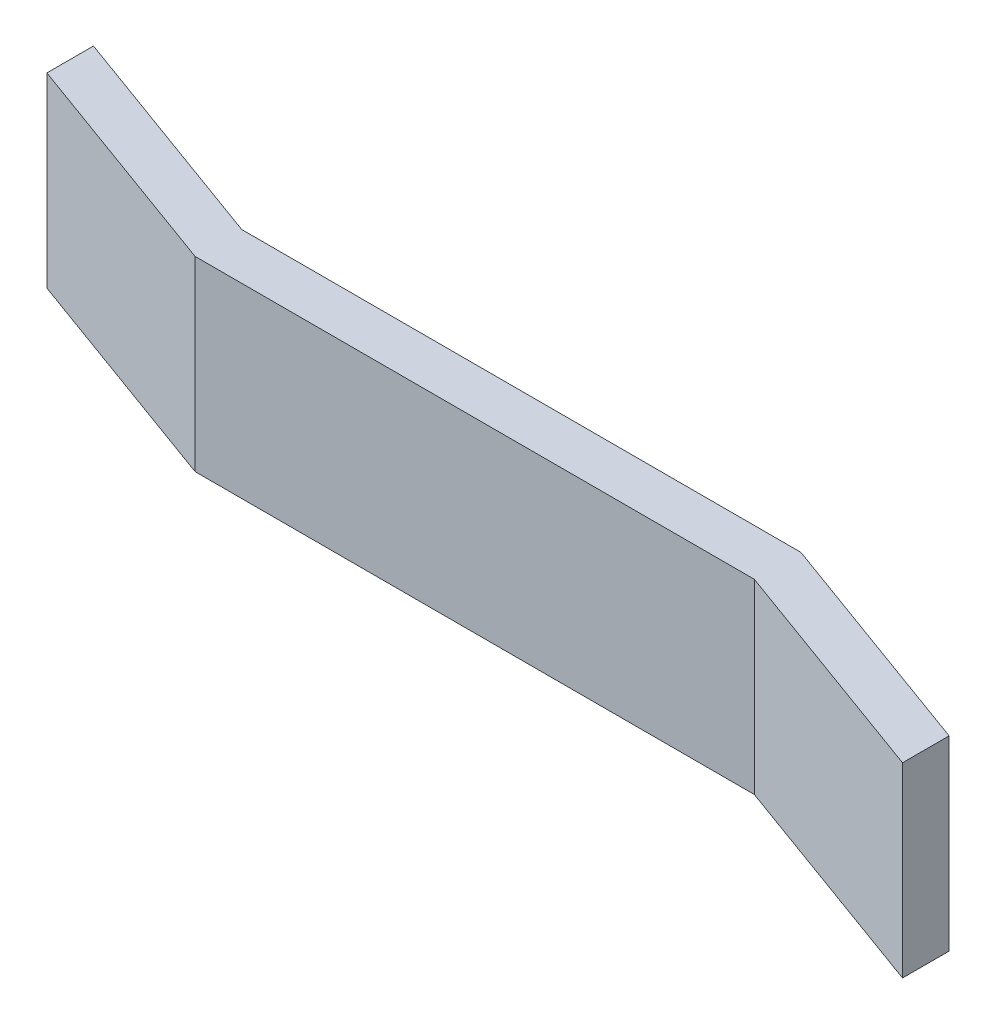
ISO-10303-21;
HEADER;
FILE_DESCRIPTION(('STEP AP214'),'2;1');
FILE_NAME('part.step','',(''),(''),'','','');
FILE_SCHEMA(('AUTOMOTIVE_DESIGN { 1 0 10303 214 1 1 1 1 }'));
ENDSEC;
DATA;
#1=APPLICATION_CONTEXT('core data for automotive mechanical design processes');
#2=APPLICATION_PROTOCOL_DEFINITION('international standard','automotive_design',2000,#1);
#3=PRODUCT_CONTEXT('',#1,'mechanical');
#4=PRODUCT('Part','Part','',(#3));
#5=PRODUCT_RELATED_PRODUCT_CATEGORY('part','',(#4));
#6=PRODUCT_DEFINITION_FORMATION('','',#4);
#7=PRODUCT_DEFINITION_CONTEXT('part definition',#1,'design');
#8=PRODUCT_DEFINITION('design','',#6,#7);
#9=PRODUCT_DEFINITION_SHAPE('','',#8);
#10=(LENGTH_UNIT() NAMED_UNIT(*) SI_UNIT(.MILLI.,.METRE.));
#11=(NAMED_UNIT(*) PLANE_ANGLE_UNIT() SI_UNIT($,.RADIAN.));
#12=(NAMED_UNIT(*) SI_UNIT($,.STERADIAN.) SOLID_ANGLE_UNIT());
#13=UNCERTAINTY_MEASURE_WITH_UNIT(LENGTH_MEASURE(1.E-05),#10,'distance_accuracy_value','');
#14=(GEOMETRIC_REPRESENTATION_CONTEXT(3) GLOBAL_UNCERTAINTY_ASSIGNED_CONTEXT((#13)) GLOBAL_UNIT_ASSIGNED_CONTEXT((#10,
#11,#12)) REPRESENTATION_CONTEXT('',''));
#15=CARTESIAN_POINT('',(0.,0.,0.));
#16=DIRECTION('',(0.,0.,1.));
#17=DIRECTION('',(1.,0.,0.));
#18=AXIS2_PLACEMENT_3D('',#15,#16,#17);
#19=CARTESIAN_POINT('',(-25.,20.,0.));
#20=DIRECTION('',(-1.,0.,0.));
#21=DIRECTION('',(0.,0.,1.));
#22=AXIS2_PLACEMENT_3D('',#19,#20,#21);
#23=PLANE('',#22);
#24=DIRECTION('',(0.,0.,-1.));
#25=VECTOR('',#24,1.);
#26=CARTESIAN_POINT('',(-25.,0.,0.));
#27=LINE('',#26,#25);
#28=CARTESIAN_POINT('',(-25.,0.,-9.09925585665488));
#29=VERTEX_POINT('',#28);
#30=CARTESIAN_POINT('',(-25.,0.,-14.0992558566549));
#31=VERTEX_POINT('',#30);
#32=EDGE_CURVE('E131',#29,#31,#27,.T.);
#33=ORIENTED_EDGE('',*,*,#32,.F.);
#34=DIRECTION('',(0.,-1.,0.));
#35=VECTOR('',#34,1.);
#36=CARTESIAN_POINT('',(-25.,20.,-9.09925585665488));
#37=LINE('',#36,#35);
#38=CARTESIAN_POINT('',(-25.,20.,-9.09925585665488));
#39=VERTEX_POINT('',#38);
#40=EDGE_CURVE('E11',#39,#29,#37,.T.);
#41=ORIENTED_EDGE('',*,*,#40,.F.);
#42=DIRECTION('',(0.,0.,-1.));
#43=VECTOR('',#42,1.);
#44=CARTESIAN_POINT('',(-25.,20.,0.));
#45=LINE('',#44,#43);
#46=CARTESIAN_POINT('',(-25.,20.,-14.0992558566549));
#47=VERTEX_POINT('',#46);
#48=EDGE_CURVE('E149',#39,#47,#45,.T.);
#49=ORIENTED_EDGE('',*,*,#48,.T.);
#50=DIRECTION('',(0.,-1.,0.));
#51=VECTOR('',#50,1.);
#52=CARTESIAN_POINT('',(-25.,20.,-14.0992558566549));
#53=LINE('',#52,#51);
#54=EDGE_CURVE('E89',#47,#31,#53,.T.);
#55=ORIENTED_EDGE('',*,*,#54,.T.);
#56=EDGE_LOOP('',(#33,#41,#49,#55));
#57=FACE_BOUND('',#56,.T.);
#58=ADVANCED_FACE('F39',(#57),#23,.T.);
#59=CARTESIAN_POINT('',(0.,20.,0.));
#60=DIRECTION('',(-0.342020143325663,0.,0.939692620785911));
#61=DIRECTION('',(0.939692620785911,0.,0.342020143325663));
#62=AXIS2_PLACEMENT_3D('',#59,#60,#61);
#63=PLANE('',#62);
#64=DIRECTION('',(-0.939692620785911,0.,-0.342020143325663));
#65=VECTOR('',#64,1.);
#66=CARTESIAN_POINT('',(0.,0.,0.));
#67=LINE('',#66,#65);
#68=CARTESIAN_POINT('',(0.,0.,0.));
#69=VERTEX_POINT('',#68);
#70=EDGE_CURVE('E134',#69,#29,#67,.T.);
#71=ORIENTED_EDGE('',*,*,#70,.F.);
#72=DIRECTION('',(0.,-1.,0.));
#73=VECTOR('',#72,1.);
#74=CARTESIAN_POINT('',(0.,20.,0.));
#75=LINE('',#74,#73);
#76=CARTESIAN_POINT('',(0.,20.,0.));
#77=VERTEX_POINT('',#76);
#78=EDGE_CURVE('E47',#77,#69,#75,.T.);
#79=ORIENTED_EDGE('',*,*,#78,.F.);
#80=DIRECTION('',(-0.939692620785911,0.,-0.342020143325663));
#81=VECTOR('',#80,1.);
#82=CARTESIAN_POINT('',(0.,20.,0.));
#83=LINE('',#82,#81);
#84=EDGE_CURVE('E173',#77,#39,#83,.T.);
#85=ORIENTED_EDGE('',*,*,#84,.T.);
#86=ORIENTED_EDGE('',*,*,#40,.T.);
#87=EDGE_LOOP('',(#71,#79,#85,#86));
#88=FACE_BOUND('',#87,.T.);
#89=ADVANCED_FACE('F172',(#88),#63,.T.);
#90=CARTESIAN_POINT('',(0.,20.,0.));
#91=DIRECTION('',(0.,0.,-1.));
#92=DIRECTION('',(-1.,0.,0.));
#93=AXIS2_PLACEMENT_3D('',#90,#91,#92);
#94=PLANE('',#93);
#95=DIRECTION('',(1.,0.,0.));
#96=VECTOR('',#95,1.);
#97=CARTESIAN_POINT('',(0.,0.,0.));
#98=LINE('',#97,#96);
#99=CARTESIAN_POINT('',(60.,0.,0.));
#100=VERTEX_POINT('',#99);
#101=EDGE_CURVE('E137',#69,#100,#98,.T.);
#102=ORIENTED_EDGE('',*,*,#101,.T.);
#103=DIRECTION('',(0.,-1.,0.));
#104=VECTOR('',#103,1.);
#105=CARTESIAN_POINT('',(60.,20.,0.));
#106=LINE('',#105,#104);
#107=CARTESIAN_POINT('',(60.,20.,0.));
#108=VERTEX_POINT('',#107);
#109=EDGE_CURVE('E156',#108,#100,#106,.T.);
#110=ORIENTED_EDGE('',*,*,#109,.F.);
#111=DIRECTION('',(1.,0.,0.));
#112=VECTOR('',#111,1.);
#113=CARTESIAN_POINT('',(0.,20.,0.));
#114=LINE('',#113,#112);
#115=EDGE_CURVE('E163',#77,#108,#114,.T.);
#116=ORIENTED_EDGE('',*,*,#115,.F.);
#117=ORIENTED_EDGE('',*,*,#78,.T.);
#118=EDGE_LOOP('',(#102,#110,#116,#117));
#119=FACE_BOUND('',#118,.T.);
#120=ADVANCED_FACE('F161',(#119),#94,.F.);
#121=CARTESIAN_POINT('',(7.01866670643069,20.,-19.2836282905962));
#122=DIRECTION('',(0.34202014332567,0.,-0.939692620785908));
#123=DIRECTION('',(-0.939692620785908,0.,-0.34202014332567));
#124=AXIS2_PLACEMENT_3D('',#121,#122,#123);
#125=PLANE('',#124);
#126=DIRECTION('',(0.939692620785908,0.,0.34202014332567));
#127=VECTOR('',#126,1.);
#128=CARTESIAN_POINT('',(7.01866670643069,0.,-19.2836282905962));
#129=LINE('',#128,#127);
#130=CARTESIAN_POINT('',(85.,0.,9.09925585665508));
#131=VERTEX_POINT('',#130);
#132=EDGE_CURVE('E139',#100,#131,#129,.T.);
#133=ORIENTED_EDGE('',*,*,#132,.T.);
#134=DIRECTION('',(0.,-1.,0.));
#135=VECTOR('',#134,1.);
#136=CARTESIAN_POINT('',(85.,20.,9.09925585665508));
#137=LINE('',#136,#135);
#138=CARTESIAN_POINT('',(85.,20.,9.09925585665508));
#139=VERTEX_POINT('',#138);
#140=EDGE_CURVE('E153',#139,#131,#137,.T.);
#141=ORIENTED_EDGE('',*,*,#140,.F.);
#142=DIRECTION('',(0.939692620785908,0.,0.34202014332567));
#143=VECTOR('',#142,1.);
#144=CARTESIAN_POINT('',(7.01866670643069,20.,-19.2836282905962));
#145=LINE('',#144,#143);
#146=EDGE_CURVE('E179',#108,#139,#145,.T.);
#147=ORIENTED_EDGE('',*,*,#146,.F.);
#148=ORIENTED_EDGE('',*,*,#109,.T.);
#149=EDGE_LOOP('',(#133,#141,#147,#148));
#150=FACE_BOUND('',#149,.T.);
#151=ADVANCED_FACE('F183',(#150),#125,.F.);
#152=CARTESIAN_POINT('',(85.,20.,0.));
#153=DIRECTION('',(-1.,0.,0.));
#154=DIRECTION('',(0.,0.,1.));
#155=AXIS2_PLACEMENT_3D('',#152,#153,#154);
#156=PLANE('',#155);
#157=DIRECTION('',(0.,0.,-1.));
#158=VECTOR('',#157,1.);
#159=CARTESIAN_POINT('',(85.,0.,0.));
#160=LINE('',#159,#158);
#161=CARTESIAN_POINT('',(85.,0.,4.09925585665508));
#162=VERTEX_POINT('',#161);
#163=EDGE_CURVE('E141',#131,#162,#160,.T.);
#164=ORIENTED_EDGE('',*,*,#163,.T.);
#165=DIRECTION('',(0.,-1.,0.));
#166=VECTOR('',#165,1.);
#167=CARTESIAN_POINT('',(85.,20.,4.09925585665508));
#168=LINE('',#167,#166);
#169=CARTESIAN_POINT('',(85.,20.,4.09925585665508));
#170=VERTEX_POINT('',#169);
#171=EDGE_CURVE('E118',#170,#162,#168,.T.);
#172=ORIENTED_EDGE('',*,*,#171,.F.);
#173=DIRECTION('',(0.,0.,-1.));
#174=VECTOR('',#173,1.);
#175=CARTESIAN_POINT('',(85.,20.,0.));
#176=LINE('',#175,#174);
#177=EDGE_CURVE('E123',#139,#170,#176,.T.);
#178=ORIENTED_EDGE('',*,*,#177,.F.);
#179=ORIENTED_EDGE('',*,*,#140,.T.);
#180=EDGE_LOOP('',(#164,#172,#178,#179));
#181=FACE_BOUND('',#180,.T.);
#182=ADVANCED_FACE('F185',(#181),#156,.F.);
#183=CARTESIAN_POINT('',(8.62563573064704,20.,-23.6987393983937));
#184=DIRECTION('',(0.34202014332567,0.,-0.939692620785908));
#185=DIRECTION('',(-0.939692620785908,0.,-0.34202014332567));
#186=AXIS2_PLACEMENT_3D('',#183,#184,#185);
#187=PLANE('',#186);
#188=DIRECTION('',(0.939692620785908,0.,0.34202014332567));
#189=VECTOR('',#188,1.);
#190=CARTESIAN_POINT('',(8.62563573064704,0.,-23.6987393983937));
#191=LINE('',#190,#189);
#192=CARTESIAN_POINT('',(60.,0.,-5.));
#193=VERTEX_POINT('',#192);
#194=EDGE_CURVE('E113',#193,#162,#191,.T.);
#195=ORIENTED_EDGE('',*,*,#194,.F.);
#196=DIRECTION('',(0.,-1.,0.));
#197=VECTOR('',#196,1.);
#198=CARTESIAN_POINT('',(60.,20.,-5.));
#199=LINE('',#198,#197);
#200=CARTESIAN_POINT('',(60.,20.,-5.));
#201=VERTEX_POINT('',#200);
#202=EDGE_CURVE('E108',#201,#193,#199,.T.);
#203=ORIENTED_EDGE('',*,*,#202,.F.);
#204=DIRECTION('',(0.939692620785908,0.,0.34202014332567));
#205=VECTOR('',#204,1.);
#206=CARTESIAN_POINT('',(8.62563573064704,20.,-23.6987393983937));
#207=LINE('',#206,#205);
#208=EDGE_CURVE('E111',#201,#170,#207,.T.);
#209=ORIENTED_EDGE('',*,*,#208,.T.);
#210=ORIENTED_EDGE('',*,*,#171,.T.);
#211=EDGE_LOOP('',(#195,#203,#209,#210));
#212=FACE_BOUND('',#211,.T.);
#213=ADVANCED_FACE('F110',(#212),#187,.T.);
#214=CARTESIAN_POINT('',(0.,20.,-5.));
#215=DIRECTION('',(0.,0.,-1.));
#216=DIRECTION('',(-1.,0.,0.));
#217=AXIS2_PLACEMENT_3D('',#214,#215,#216);
#218=PLANE('',#217);
#219=DIRECTION('',(1.,0.,0.));
#220=VECTOR('',#219,1.);
#221=CARTESIAN_POINT('',(0.,0.,-5.));
#222=LINE('',#221,#220);
#223=CARTESIAN_POINT('',(0.,0.,-5.));
#224=VERTEX_POINT('',#223);
#225=EDGE_CURVE('E145',#224,#193,#222,.T.);
#226=ORIENTED_EDGE('',*,*,#225,.F.);
#227=DIRECTION('',(0.,-1.,0.));
#228=VECTOR('',#227,1.);
#229=CARTESIAN_POINT('',(0.,20.,-5.));
#230=LINE('',#229,#228);
#231=CARTESIAN_POINT('',(0.,20.,-5.));
#232=VERTEX_POINT('',#231);
#233=EDGE_CURVE('E82',#232,#224,#230,.T.);
#234=ORIENTED_EDGE('',*,*,#233,.F.);
#235=DIRECTION('',(1.,0.,0.));
#236=VECTOR('',#235,1.);
#237=CARTESIAN_POINT('',(0.,20.,-5.));
#238=LINE('',#237,#236);
#239=EDGE_CURVE('E121',#232,#201,#238,.T.);
#240=ORIENTED_EDGE('',*,*,#239,.T.);
#241=ORIENTED_EDGE('',*,*,#202,.T.);
#242=EDGE_LOOP('',(#226,#234,#240,#241));
#243=FACE_BOUND('',#242,.T.);
#244=ADVANCED_FACE('F126',(#243),#218,.T.);
#245=CARTESIAN_POINT('',(1.60696902421632,20.,-4.41511110779747));
#246=DIRECTION('',(-0.342020143325663,0.,0.93969262078591));
#247=DIRECTION('',(0.939692620785911,0.,0.342020143325663));
#248=AXIS2_PLACEMENT_3D('',#245,#246,#247);
#249=PLANE('',#248);
#250=DIRECTION('',(-0.939692620785911,0.,-0.342020143325663));
#251=VECTOR('',#250,1.);
#252=CARTESIAN_POINT('',(1.60696902421632,0.,-4.41511110779747));
#253=LINE('',#252,#251);
#254=EDGE_CURVE('E147',#224,#31,#253,.T.);
#255=ORIENTED_EDGE('',*,*,#254,.T.);
#256=ORIENTED_EDGE('',*,*,#54,.F.);
#257=DIRECTION('',(-0.939692620785911,0.,-0.342020143325663));
#258=VECTOR('',#257,1.);
#259=CARTESIAN_POINT('',(1.60696902421632,20.,-4.41511110779747));
#260=LINE('',#259,#258);
#261=EDGE_CURVE('E55',#232,#47,#260,.T.);
#262=ORIENTED_EDGE('',*,*,#261,.F.);
#263=ORIENTED_EDGE('',*,*,#233,.T.);
#264=EDGE_LOOP('',(#255,#256,#262,#263));
#265=FACE_BOUND('',#264,.T.);
#266=ADVANCED_FACE('F174',(#265),#249,.F.);
#267=CARTESIAN_POINT('',(0.,20.,0.));
#268=DIRECTION('',(0.,1.,0.));
#269=DIRECTION('',(0.,0.,1.));
#270=AXIS2_PLACEMENT_3D('',#267,#268,#269);
#271=PLANE('',#270);
#272=ORIENTED_EDGE('',*,*,#48,.F.);
#273=ORIENTED_EDGE('',*,*,#84,.F.);
#274=ORIENTED_EDGE('',*,*,#115,.T.);
#275=ORIENTED_EDGE('',*,*,#146,.T.);
#276=ORIENTED_EDGE('',*,*,#177,.T.);
#277=ORIENTED_EDGE('',*,*,#208,.F.);
#278=ORIENTED_EDGE('',*,*,#239,.F.);
#279=ORIENTED_EDGE('',*,*,#261,.T.);
#280=EDGE_LOOP('',(#272,#273,#274,#275,#276,#277,#278,#279));
#281=FACE_BOUND('',#280,.T.);
#282=ADVANCED_FACE('F120',(#281),#271,.T.);
#283=CARTESIAN_POINT('',(0.,0.,0.));
#284=DIRECTION('',(0.,1.,0.));
#285=DIRECTION('',(0.,0.,1.));
#286=AXIS2_PLACEMENT_3D('',#283,#284,#285);
#287=PLANE('',#286);
#288=ORIENTED_EDGE('',*,*,#32,.T.);
#289=ORIENTED_EDGE('',*,*,#254,.F.);
#290=ORIENTED_EDGE('',*,*,#225,.T.);
#291=ORIENTED_EDGE('',*,*,#194,.T.);
#292=ORIENTED_EDGE('',*,*,#163,.F.);
#293=ORIENTED_EDGE('',*,*,#132,.F.);
#294=ORIENTED_EDGE('',*,*,#101,.F.);
#295=ORIENTED_EDGE('',*,*,#70,.T.);
#296=EDGE_LOOP('',(#288,#289,#290,#291,#292,#293,#294,#295));
#297=FACE_BOUND('',#296,.T.);
#298=ADVANCED_FACE('F170',(#297),#287,.F.);
#299=CLOSED_SHELL('',(#58,#89,#120,#151,#182,#213,#244,#266,#282,#298));
#300=MANIFOLD_SOLID_BREP('B2',#299);
#301=ADVANCED_BREP_SHAPE_REPRESENTATION('',(#18,#300),#14);
#302=SHAPE_DEFINITION_REPRESENTATION(#9,#301);
ENDSEC;
END-ISO-10303-21;
